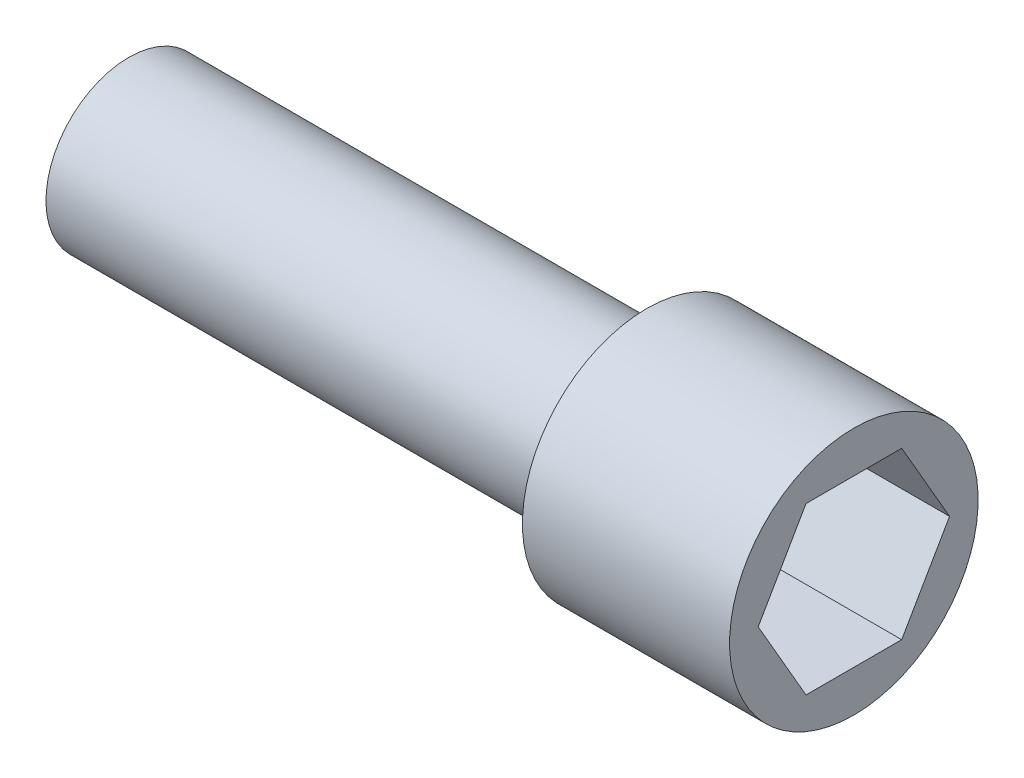
ISO-10303-21;
HEADER;
FILE_DESCRIPTION(('STEP AP214'),'2;1');
FILE_NAME('part.step','',(''),(''),'','','');
FILE_SCHEMA(('AUTOMOTIVE_DESIGN { 1 0 10303 214 1 1 1 1 }'));
ENDSEC;
DATA;
#1=APPLICATION_CONTEXT('core data for automotive mechanical design processes');
#2=APPLICATION_PROTOCOL_DEFINITION('international standard','automotive_design',2000,#1);
#3=PRODUCT_CONTEXT('',#1,'mechanical');
#4=PRODUCT('Part','Part','',(#3));
#5=PRODUCT_RELATED_PRODUCT_CATEGORY('part','',(#4));
#6=PRODUCT_DEFINITION_FORMATION('','',#4);
#7=PRODUCT_DEFINITION_CONTEXT('part definition',#1,'design');
#8=PRODUCT_DEFINITION('design','',#6,#7);
#9=PRODUCT_DEFINITION_SHAPE('','',#8);
#10=(LENGTH_UNIT() NAMED_UNIT(*) SI_UNIT(.MILLI.,.METRE.));
#11=(NAMED_UNIT(*) PLANE_ANGLE_UNIT() SI_UNIT($,.RADIAN.));
#12=(NAMED_UNIT(*) SI_UNIT($,.STERADIAN.) SOLID_ANGLE_UNIT());
#13=UNCERTAINTY_MEASURE_WITH_UNIT(LENGTH_MEASURE(1.E-05),#10,'distance_accuracy_value','');
#14=(GEOMETRIC_REPRESENTATION_CONTEXT(3) GLOBAL_UNCERTAINTY_ASSIGNED_CONTEXT((#13)) GLOBAL_UNIT_ASSIGNED_CONTEXT((#10,
#11,#12)) REPRESENTATION_CONTEXT('',''));
#15=CARTESIAN_POINT('',(0.,0.,0.));
#16=DIRECTION('',(0.,0.,1.));
#17=DIRECTION('',(1.,0.,0.));
#18=AXIS2_PLACEMENT_3D('',#15,#16,#17);
#19=CARTESIAN_POINT('',(10.,5.99999999999999,0.));
#20=DIRECTION('',(1.,0.,0.));
#21=DIRECTION('',(0.,1.,0.));
#22=AXIS2_PLACEMENT_3D('',#19,#20,#21);
#23=PLANE('',#22);
#24=DIRECTION('',(0.,0.866025403784439,-0.5));
#25=VECTOR('',#24,1.);
#26=CARTESIAN_POINT('',(10.,-4.,-2.3094010767585));
#27=LINE('',#26,#25);
#28=CARTESIAN_POINT('',(10.,-4.,-2.3094010767585));
#29=VERTEX_POINT('',#28);
#30=CARTESIAN_POINT('',(10.,0.,-4.61880215351701));
#31=VERTEX_POINT('',#30);
#32=EDGE_CURVE('E58',#29,#31,#27,.T.);
#33=ORIENTED_EDGE('',*,*,#32,.F.);
#34=DIRECTION('',(0.,0.,-1.));
#35=VECTOR('',#34,1.);
#36=CARTESIAN_POINT('',(10.,-4.,2.3094010767585));
#37=LINE('',#36,#35);
#38=CARTESIAN_POINT('',(10.,-4.,2.3094010767585));
#39=VERTEX_POINT('',#38);
#40=EDGE_CURVE('E151',#39,#29,#37,.T.);
#41=ORIENTED_EDGE('',*,*,#40,.F.);
#42=DIRECTION('',(0.,-0.866025403784438,-0.5));
#43=VECTOR('',#42,1.);
#44=CARTESIAN_POINT('',(10.,0.,4.61880215351701));
#45=LINE('',#44,#43);
#46=CARTESIAN_POINT('',(10.,0.,4.61880215351701));
#47=VERTEX_POINT('',#46);
#48=EDGE_CURVE('E148',#47,#39,#45,.T.);
#49=ORIENTED_EDGE('',*,*,#48,.F.);
#50=DIRECTION('',(0.,-0.866025403784439,0.5));
#51=VECTOR('',#50,1.);
#52=CARTESIAN_POINT('',(10.,4.,2.3094010767585));
#53=LINE('',#52,#51);
#54=CARTESIAN_POINT('',(10.,4.,2.3094010767585));
#55=VERTEX_POINT('',#54);
#56=EDGE_CURVE('E106',#55,#47,#53,.T.);
#57=ORIENTED_EDGE('',*,*,#56,.F.);
#58=DIRECTION('',(0.,0.,1.));
#59=VECTOR('',#58,1.);
#60=CARTESIAN_POINT('',(10.,4.,-2.3094010767585));
#61=LINE('',#60,#59);
#62=CARTESIAN_POINT('',(10.,4.,-2.3094010767585));
#63=VERTEX_POINT('',#62);
#64=EDGE_CURVE('E142',#63,#55,#61,.T.);
#65=ORIENTED_EDGE('',*,*,#64,.F.);
#66=DIRECTION('',(0.,0.866025403784438,0.5));
#67=VECTOR('',#66,1.);
#68=CARTESIAN_POINT('',(10.,0.,-4.61880215351701));
#69=LINE('',#68,#67);
#70=EDGE_CURVE('E138',#31,#63,#69,.T.);
#71=ORIENTED_EDGE('',*,*,#70,.F.);
#72=EDGE_LOOP('',(#33,#41,#49,#57,#65,#71));
#73=FACE_BOUND('',#72,.T.);
#74=CARTESIAN_POINT('',(10.,0.,0.));
#75=DIRECTION('',(1.,0.,0.));
#76=DIRECTION('',(0.,1.,0.));
#77=AXIS2_PLACEMENT_3D('',#74,#75,#76);
#78=CIRCLE('',#77,5.99999999999999);
#79=CARTESIAN_POINT('',(10.,5.99999999999999,0.));
#80=VERTEX_POINT('',#79);
#81=EDGE_CURVE('E157',#80,#80,#78,.T.);
#82=ORIENTED_EDGE('',*,*,#81,.T.);
#83=EDGE_LOOP('',(#82));
#84=FACE_BOUND('',#83,.T.);
#85=ADVANCED_FACE('F43',(#73,#84),#23,.T.);
#86=CARTESIAN_POINT('',(-25.,0.,0.));
#87=DIRECTION('',(-1.,0.,0.));
#88=DIRECTION('',(0.,-1.,0.));
#89=AXIS2_PLACEMENT_3D('',#86,#87,#88);
#90=PLANE('',#89);
#91=CARTESIAN_POINT('',(-25.,0.,0.));
#92=DIRECTION('',(1.,0.,0.));
#93=DIRECTION('',(0.,1.,0.));
#94=AXIS2_PLACEMENT_3D('',#91,#92,#93);
#95=CIRCLE('',#94,4.);
#96=CARTESIAN_POINT('',(-25.,3.99999999999999,0.));
#97=VERTEX_POINT('',#96);
#98=EDGE_CURVE('E11',#97,#97,#95,.T.);
#99=ORIENTED_EDGE('',*,*,#98,.F.);
#100=EDGE_LOOP('',(#99));
#101=FACE_BOUND('',#100,.T.);
#102=ADVANCED_FACE('F182',(#101),#90,.T.);
#103=CARTESIAN_POINT('',(10.,0.,0.));
#104=DIRECTION('',(1.,0.,0.));
#105=DIRECTION('',(0.,1.,0.));
#106=AXIS2_PLACEMENT_3D('',#103,#104,#105);
#107=CYLINDRICAL_SURFACE('',#106,4.);
#108=ORIENTED_EDGE('',*,*,#98,.T.);
#109=EDGE_LOOP('',(#108));
#110=FACE_BOUND('',#109,.T.);
#111=CARTESIAN_POINT('',(0.,0.,0.));
#112=DIRECTION('',(1.,0.,0.));
#113=DIRECTION('',(0.,1.,0.));
#114=AXIS2_PLACEMENT_3D('',#111,#112,#113);
#115=CIRCLE('',#114,4.);
#116=CARTESIAN_POINT('',(0.,3.99999999999999,0.));
#117=VERTEX_POINT('',#116);
#118=EDGE_CURVE('E51',#117,#117,#115,.T.);
#119=ORIENTED_EDGE('',*,*,#118,.F.);
#120=EDGE_LOOP('',(#119));
#121=FACE_BOUND('',#120,.T.);
#122=ADVANCED_FACE('F180',(#110,#121),#107,.T.);
#123=CARTESIAN_POINT('',(0.,3.99999999999999,0.));
#124=DIRECTION('',(-1.,0.,0.));
#125=DIRECTION('',(0.,-1.,0.));
#126=AXIS2_PLACEMENT_3D('',#123,#124,#125);
#127=PLANE('',#126);
#128=ORIENTED_EDGE('',*,*,#118,.T.);
#129=EDGE_LOOP('',(#128));
#130=FACE_BOUND('',#129,.T.);
#131=CARTESIAN_POINT('',(0.,0.,0.));
#132=DIRECTION('',(1.,0.,0.));
#133=DIRECTION('',(0.,1.,0.));
#134=AXIS2_PLACEMENT_3D('',#131,#132,#133);
#135=CIRCLE('',#134,6.);
#136=CARTESIAN_POINT('',(0.,5.99999999999999,0.));
#137=VERTEX_POINT('',#136);
#138=EDGE_CURVE('E170',#137,#137,#135,.T.);
#139=ORIENTED_EDGE('',*,*,#138,.F.);
#140=EDGE_LOOP('',(#139));
#141=FACE_BOUND('',#140,.T.);
#142=ADVANCED_FACE('F177',(#130,#141),#127,.T.);
#143=CARTESIAN_POINT('',(10.,0.,0.));
#144=DIRECTION('',(1.,0.,0.));
#145=DIRECTION('',(0.,1.,0.));
#146=AXIS2_PLACEMENT_3D('',#143,#144,#145);
#147=CYLINDRICAL_SURFACE('',#146,5.99999999999999);
#148=ORIENTED_EDGE('',*,*,#138,.T.);
#149=EDGE_LOOP('',(#148));
#150=FACE_BOUND('',#149,.T.);
#151=ORIENTED_EDGE('',*,*,#81,.F.);
#152=EDGE_LOOP('',(#151));
#153=FACE_BOUND('',#152,.T.);
#154=ADVANCED_FACE('F189',(#150,#153),#147,.T.);
#155=CARTESIAN_POINT('',(3.,-4.,-2.3094010767585));
#156=DIRECTION('',(0.,-0.5,-0.866025403784439));
#157=DIRECTION('',(0.,0.866025403784439,-0.5));
#158=AXIS2_PLACEMENT_3D('',#155,#156,#157);
#159=PLANE('',#158);
#160=ORIENTED_EDGE('',*,*,#32,.T.);
#161=DIRECTION('',(1.,0.,0.));
#162=VECTOR('',#161,1.);
#163=CARTESIAN_POINT('',(3.,0.,-4.61880215351701));
#164=LINE('',#163,#162);
#165=CARTESIAN_POINT('',(3.,0.,-4.61880215351701));
#166=VERTEX_POINT('',#165);
#167=EDGE_CURVE('E88',#166,#31,#164,.T.);
#168=ORIENTED_EDGE('',*,*,#167,.F.);
#169=DIRECTION('',(0.,0.866025403784439,-0.5));
#170=VECTOR('',#169,1.);
#171=CARTESIAN_POINT('',(3.,-4.,-2.3094010767585));
#172=LINE('',#171,#170);
#173=CARTESIAN_POINT('',(3.,-4.,-2.3094010767585));
#174=VERTEX_POINT('',#173);
#175=EDGE_CURVE('E154',#174,#166,#172,.T.);
#176=ORIENTED_EDGE('',*,*,#175,.F.);
#177=DIRECTION('',(1.,0.,0.));
#178=VECTOR('',#177,1.);
#179=CARTESIAN_POINT('',(3.,-4.,-2.3094010767585));
#180=LINE('',#179,#178);
#181=EDGE_CURVE('E66',#174,#29,#180,.T.);
#182=ORIENTED_EDGE('',*,*,#181,.T.);
#183=EDGE_LOOP('',(#160,#168,#176,#182));
#184=FACE_BOUND('',#183,.T.);
#185=ADVANCED_FACE('F202',(#184),#159,.F.);
#186=CARTESIAN_POINT('',(3.,-4.,2.3094010767585));
#187=DIRECTION('',(0.,-1.,0.));
#188=DIRECTION('',(1.,0.,0.));
#189=AXIS2_PLACEMENT_3D('',#186,#187,#188);
#190=PLANE('',#189);
#191=ORIENTED_EDGE('',*,*,#40,.T.);
#192=ORIENTED_EDGE('',*,*,#181,.F.);
#193=DIRECTION('',(0.,0.,-1.));
#194=VECTOR('',#193,1.);
#195=CARTESIAN_POINT('',(3.,-4.,2.3094010767585));
#196=LINE('',#195,#194);
#197=CARTESIAN_POINT('',(3.,-4.,2.3094010767585));
#198=VERTEX_POINT('',#197);
#199=EDGE_CURVE('E120',#198,#174,#196,.T.);
#200=ORIENTED_EDGE('',*,*,#199,.F.);
#201=DIRECTION('',(1.,0.,0.));
#202=VECTOR('',#201,1.);
#203=CARTESIAN_POINT('',(3.,-4.,2.3094010767585));
#204=LINE('',#203,#202);
#205=EDGE_CURVE('E111',#198,#39,#204,.T.);
#206=ORIENTED_EDGE('',*,*,#205,.T.);
#207=EDGE_LOOP('',(#191,#192,#200,#206));
#208=FACE_BOUND('',#207,.T.);
#209=ADVANCED_FACE('F208',(#208),#190,.F.);
#210=CARTESIAN_POINT('',(3.,0.,4.61880215351701));
#211=DIRECTION('',(0.,-0.5,0.866025403784438));
#212=DIRECTION('',(0.,-0.866025403784439,-0.5));
#213=AXIS2_PLACEMENT_3D('',#210,#211,#212);
#214=PLANE('',#213);
#215=ORIENTED_EDGE('',*,*,#48,.T.);
#216=ORIENTED_EDGE('',*,*,#205,.F.);
#217=DIRECTION('',(0.,-0.866025403784438,-0.5));
#218=VECTOR('',#217,1.);
#219=CARTESIAN_POINT('',(3.,0.,4.61880215351701));
#220=LINE('',#219,#218);
#221=CARTESIAN_POINT('',(3.,0.,4.61880215351701));
#222=VERTEX_POINT('',#221);
#223=EDGE_CURVE('E115',#222,#198,#220,.T.);
#224=ORIENTED_EDGE('',*,*,#223,.F.);
#225=DIRECTION('',(1.,0.,0.));
#226=VECTOR('',#225,1.);
#227=CARTESIAN_POINT('',(3.,0.,4.61880215351701));
#228=LINE('',#227,#226);
#229=EDGE_CURVE('E99',#222,#47,#228,.T.);
#230=ORIENTED_EDGE('',*,*,#229,.T.);
#231=EDGE_LOOP('',(#215,#216,#224,#230));
#232=FACE_BOUND('',#231,.T.);
#233=ADVANCED_FACE('F116',(#232),#214,.F.);
#234=CARTESIAN_POINT('',(3.,4.,2.3094010767585));
#235=DIRECTION('',(0.,0.5,0.866025403784439));
#236=DIRECTION('',(0.,-0.866025403784439,0.5));
#237=AXIS2_PLACEMENT_3D('',#234,#235,#236);
#238=PLANE('',#237);
#239=ORIENTED_EDGE('',*,*,#56,.T.);
#240=ORIENTED_EDGE('',*,*,#229,.F.);
#241=DIRECTION('',(0.,-0.866025403784439,0.5));
#242=VECTOR('',#241,1.);
#243=CARTESIAN_POINT('',(3.,4.,2.3094010767585));
#244=LINE('',#243,#242);
#245=CARTESIAN_POINT('',(3.,4.,2.3094010767585));
#246=VERTEX_POINT('',#245);
#247=EDGE_CURVE('E103',#246,#222,#244,.T.);
#248=ORIENTED_EDGE('',*,*,#247,.F.);
#249=DIRECTION('',(1.,0.,0.));
#250=VECTOR('',#249,1.);
#251=CARTESIAN_POINT('',(3.,4.,2.3094010767585));
#252=LINE('',#251,#250);
#253=EDGE_CURVE('E112',#246,#55,#252,.T.);
#254=ORIENTED_EDGE('',*,*,#253,.T.);
#255=EDGE_LOOP('',(#239,#240,#248,#254));
#256=FACE_BOUND('',#255,.T.);
#257=ADVANCED_FACE('F101',(#256),#238,.F.);
#258=CARTESIAN_POINT('',(3.,4.,-2.3094010767585));
#259=DIRECTION('',(0.,1.,0.));
#260=DIRECTION('',(-1.,0.,0.));
#261=AXIS2_PLACEMENT_3D('',#258,#259,#260);
#262=PLANE('',#261);
#263=ORIENTED_EDGE('',*,*,#64,.T.);
#264=ORIENTED_EDGE('',*,*,#253,.F.);
#265=DIRECTION('',(0.,0.,1.));
#266=VECTOR('',#265,1.);
#267=CARTESIAN_POINT('',(3.,4.,-2.3094010767585));
#268=LINE('',#267,#266);
#269=CARTESIAN_POINT('',(3.,4.,-2.3094010767585));
#270=VERTEX_POINT('',#269);
#271=EDGE_CURVE('E126',#270,#246,#268,.T.);
#272=ORIENTED_EDGE('',*,*,#271,.F.);
#273=DIRECTION('',(1.,0.,0.));
#274=VECTOR('',#273,1.);
#275=CARTESIAN_POINT('',(3.,4.,-2.3094010767585));
#276=LINE('',#275,#274);
#277=EDGE_CURVE('E162',#270,#63,#276,.T.);
#278=ORIENTED_EDGE('',*,*,#277,.T.);
#279=EDGE_LOOP('',(#263,#264,#272,#278));
#280=FACE_BOUND('',#279,.T.);
#281=ADVANCED_FACE('F214',(#280),#262,.F.);
#282=CARTESIAN_POINT('',(3.,0.,-4.61880215351701));
#283=DIRECTION('',(0.,0.5,-0.866025403784438));
#284=DIRECTION('',(0.,0.866025403784438,0.5));
#285=AXIS2_PLACEMENT_3D('',#282,#283,#284);
#286=PLANE('',#285);
#287=ORIENTED_EDGE('',*,*,#70,.T.);
#288=ORIENTED_EDGE('',*,*,#277,.F.);
#289=DIRECTION('',(0.,0.866025403784438,0.5));
#290=VECTOR('',#289,1.);
#291=CARTESIAN_POINT('',(3.,0.,-4.61880215351701));
#292=LINE('',#291,#290);
#293=EDGE_CURVE('E130',#166,#270,#292,.T.);
#294=ORIENTED_EDGE('',*,*,#293,.F.);
#295=ORIENTED_EDGE('',*,*,#167,.T.);
#296=EDGE_LOOP('',(#287,#288,#294,#295));
#297=FACE_BOUND('',#296,.T.);
#298=ADVANCED_FACE('F211',(#297),#286,.F.);
#299=CARTESIAN_POINT('',(3.,0.,0.));
#300=DIRECTION('',(1.,0.,0.));
#301=DIRECTION('',(0.,0.,-1.));
#302=AXIS2_PLACEMENT_3D('',#299,#300,#301);
#303=PLANE('',#302);
#304=ORIENTED_EDGE('',*,*,#175,.T.);
#305=ORIENTED_EDGE('',*,*,#293,.T.);
#306=ORIENTED_EDGE('',*,*,#271,.T.);
#307=ORIENTED_EDGE('',*,*,#247,.T.);
#308=ORIENTED_EDGE('',*,*,#223,.T.);
#309=ORIENTED_EDGE('',*,*,#199,.T.);
#310=EDGE_LOOP('',(#304,#305,#306,#307,#308,#309));
#311=FACE_BOUND('',#310,.T.);
#312=ADVANCED_FACE('F123',(#311),#303,.T.);
#313=CLOSED_SHELL('',(#85,#102,#122,#142,#154,#185,#209,#233,#257,#281,#298,#312));
#314=MANIFOLD_SOLID_BREP('B2',#313);
#315=ADVANCED_BREP_SHAPE_REPRESENTATION('',(#18,#314),#14);
#316=SHAPE_DEFINITION_REPRESENTATION(#9,#315);
ENDSEC;
END-ISO-10303-21;
